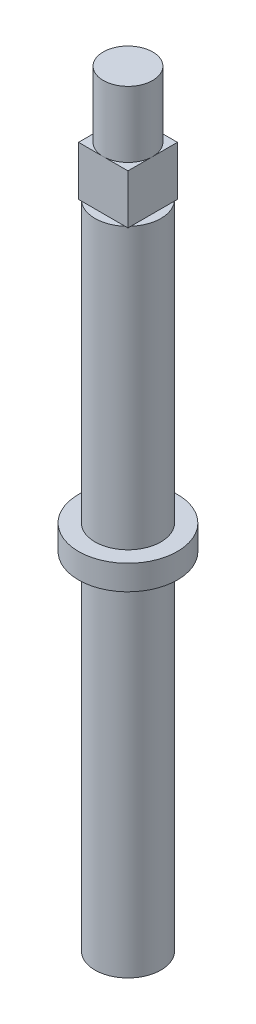
ISO-10303-21;
HEADER;
FILE_DESCRIPTION(('STEP AP214'),'2;1');
FILE_NAME('part.step','',(''),(''),'','','');
FILE_SCHEMA(('AUTOMOTIVE_DESIGN { 1 0 10303 214 1 1 1 1 }'));
ENDSEC;
DATA;
#1=APPLICATION_CONTEXT('core data for automotive mechanical design processes');
#2=APPLICATION_PROTOCOL_DEFINITION('international standard','automotive_design',2000,#1);
#3=PRODUCT_CONTEXT('',#1,'mechanical');
#4=PRODUCT('Part','Part','',(#3));
#5=PRODUCT_RELATED_PRODUCT_CATEGORY('part','',(#4));
#6=PRODUCT_DEFINITION_FORMATION('','',#4);
#7=PRODUCT_DEFINITION_CONTEXT('part definition',#1,'design');
#8=PRODUCT_DEFINITION('design','',#6,#7);
#9=PRODUCT_DEFINITION_SHAPE('','',#8);
#10=(LENGTH_UNIT() NAMED_UNIT(*) SI_UNIT(.MILLI.,.METRE.));
#11=(NAMED_UNIT(*) PLANE_ANGLE_UNIT() SI_UNIT($,.RADIAN.));
#12=(NAMED_UNIT(*) SI_UNIT($,.STERADIAN.) SOLID_ANGLE_UNIT());
#13=UNCERTAINTY_MEASURE_WITH_UNIT(LENGTH_MEASURE(1.E-05),#10,'distance_accuracy_value','');
#14=(GEOMETRIC_REPRESENTATION_CONTEXT(3) GLOBAL_UNCERTAINTY_ASSIGNED_CONTEXT((#13)) GLOBAL_UNIT_ASSIGNED_CONTEXT((#10,
#11,#12)) REPRESENTATION_CONTEXT('',''));
#15=CARTESIAN_POINT('',(0.,0.,0.));
#16=DIRECTION('',(0.,0.,1.));
#17=DIRECTION('',(1.,0.,0.));
#18=AXIS2_PLACEMENT_3D('',#15,#16,#17);
#19=CARTESIAN_POINT('',(0.,32.5,-3.00000000000001));
#20=DIRECTION('',(0.,-1.,0.));
#21=DIRECTION('',(0.,0.,-1.));
#22=AXIS2_PLACEMENT_3D('',#19,#20,#21);
#23=PLANE('',#22);
#24=DIRECTION('',(0.,0.,-1.));
#25=VECTOR('',#24,1.);
#26=CARTESIAN_POINT('',(3.,32.5,3.));
#27=LINE('',#26,#25);
#28=CARTESIAN_POINT('',(3.,32.5,2.64575131106459));
#29=VERTEX_POINT('',#28);
#30=CARTESIAN_POINT('',(3.,32.5,-2.64575131106461));
#31=VERTEX_POINT('',#30);
#32=EDGE_CURVE('E226',#29,#31,#27,.T.);
#33=ORIENTED_EDGE('',*,*,#32,.F.);
#34=CARTESIAN_POINT('',(0.,32.5,0.));
#35=DIRECTION('',(0.,1.,0.));
#36=DIRECTION('',(0.,0.,1.));
#37=AXIS2_PLACEMENT_3D('',#34,#35,#36);
#38=CIRCLE('',#37,4.);
#39=EDGE_CURVE('E185',#29,#31,#38,.T.);
#40=ORIENTED_EDGE('',*,*,#39,.T.);
#41=EDGE_LOOP('',(#33,#40));
#42=FACE_BOUND('',#41,.T.);
#43=ADVANCED_FACE('F49',(#42),#23,.F.);
#44=DIRECTION('',(-1.,0.,0.));
#45=VECTOR('',#44,1.);
#46=CARTESIAN_POINT('',(-3.,32.5,-3.));
#47=LINE('',#46,#45);
#48=CARTESIAN_POINT('',(2.6457513110646,32.5,-3.));
#49=VERTEX_POINT('',#48);
#50=CARTESIAN_POINT('',(-2.6457513110646,32.5,-3.));
#51=VERTEX_POINT('',#50);
#52=EDGE_CURVE('E231',#49,#51,#47,.T.);
#53=ORIENTED_EDGE('',*,*,#52,.F.);
#54=EDGE_CURVE('E289',#49,#51,#38,.T.);
#55=ORIENTED_EDGE('',*,*,#54,.T.);
#56=EDGE_LOOP('',(#53,#55));
#57=FACE_BOUND('',#56,.T.);
#58=ADVANCED_FACE('F309',(#57),#23,.F.);
#59=DIRECTION('',(0.,0.,1.));
#60=VECTOR('',#59,1.);
#61=CARTESIAN_POINT('',(-3.,32.5,3.));
#62=LINE('',#61,#60);
#63=CARTESIAN_POINT('',(-3.,32.5,-2.64575131106461));
#64=VERTEX_POINT('',#63);
#65=CARTESIAN_POINT('',(-3.,32.5,2.64575131106459));
#66=VERTEX_POINT('',#65);
#67=EDGE_CURVE('E237',#64,#66,#62,.T.);
#68=ORIENTED_EDGE('',*,*,#67,.F.);
#69=EDGE_CURVE('E254',#64,#66,#38,.T.);
#70=ORIENTED_EDGE('',*,*,#69,.T.);
#71=EDGE_LOOP('',(#68,#70));
#72=FACE_BOUND('',#71,.T.);
#73=ADVANCED_FACE('F307',(#72),#23,.F.);
#74=DIRECTION('',(1.,0.,0.));
#75=VECTOR('',#74,1.);
#76=CARTESIAN_POINT('',(-3.,32.5,3.));
#77=LINE('',#76,#75);
#78=CARTESIAN_POINT('',(-2.64575131106459,32.5,2.99999999999999));
#79=VERTEX_POINT('',#78);
#80=CARTESIAN_POINT('',(2.64575131106459,32.5,2.99999999999999));
#81=VERTEX_POINT('',#80);
#82=EDGE_CURVE('E240',#79,#81,#77,.T.);
#83=ORIENTED_EDGE('',*,*,#82,.F.);
#84=EDGE_CURVE('E180',#79,#81,#38,.T.);
#85=ORIENTED_EDGE('',*,*,#84,.T.);
#86=EDGE_LOOP('',(#83,#85));
#87=FACE_BOUND('',#86,.T.);
#88=ADVANCED_FACE('F261',(#87),#23,.F.);
#89=CARTESIAN_POINT('',(0.,46.5,0.));
#90=DIRECTION('',(0.,1.,0.));
#91=DIRECTION('',(0.,0.,1.));
#92=AXIS2_PLACEMENT_3D('',#89,#90,#91);
#93=CYLINDRICAL_SURFACE('',#92,4.00000000000001);
#94=EDGE_CURVE('E181',#81,#29,#38,.T.);
#95=ORIENTED_EDGE('',*,*,#94,.F.);
#96=ORIENTED_EDGE('',*,*,#84,.F.);
#97=EDGE_CURVE('E249',#66,#79,#38,.T.);
#98=ORIENTED_EDGE('',*,*,#97,.F.);
#99=ORIENTED_EDGE('',*,*,#69,.F.);
#100=EDGE_CURVE('E257',#51,#64,#38,.T.);
#101=ORIENTED_EDGE('',*,*,#100,.F.);
#102=ORIENTED_EDGE('',*,*,#54,.F.);
#103=EDGE_CURVE('E291',#31,#49,#38,.T.);
#104=ORIENTED_EDGE('',*,*,#103,.F.);
#105=ORIENTED_EDGE('',*,*,#39,.F.);
#106=EDGE_LOOP('',(#95,#96,#98,#99,#101,#102,#104,#105));
#107=FACE_BOUND('',#106,.T.);
#108=CARTESIAN_POINT('',(0.,-1.49999999999999,0.));
#109=DIRECTION('',(0.,1.,0.));
#110=DIRECTION('',(0.,0.,1.));
#111=AXIS2_PLACEMENT_3D('',#108,#109,#110);
#112=CIRCLE('',#111,4.00000000000001);
#113=CARTESIAN_POINT('',(0.,-1.49999999999999,4.));
#114=VERTEX_POINT('',#113);
#115=EDGE_CURVE('E176',#114,#114,#112,.T.);
#116=ORIENTED_EDGE('',*,*,#115,.T.);
#117=EDGE_LOOP('',(#116));
#118=FACE_BOUND('',#117,.T.);
#119=ADVANCED_FACE('F264',(#107,#118),#93,.T.);
#120=CARTESIAN_POINT('',(0.,-1.5,-4.00000000000002));
#121=DIRECTION('',(0.,-1.,0.));
#122=DIRECTION('',(0.,0.,-1.));
#123=AXIS2_PLACEMENT_3D('',#120,#121,#122);
#124=PLANE('',#123);
#125=ORIENTED_EDGE('',*,*,#115,.F.);
#126=EDGE_LOOP('',(#125));
#127=FACE_BOUND('',#126,.T.);
#128=CARTESIAN_POINT('',(0.,-1.49999999999999,0.));
#129=DIRECTION('',(0.,1.,0.));
#130=DIRECTION('',(0.,0.,1.));
#131=AXIS2_PLACEMENT_3D('',#128,#129,#130);
#132=CIRCLE('',#131,6.00000000000001);
#133=CARTESIAN_POINT('',(0.,-1.49999999999999,6.));
#134=VERTEX_POINT('',#133);
#135=EDGE_CURVE('E172',#134,#134,#132,.T.);
#136=ORIENTED_EDGE('',*,*,#135,.T.);
#137=EDGE_LOOP('',(#136));
#138=FACE_BOUND('',#137,.T.);
#139=ADVANCED_FACE('F475',(#127,#138),#124,.F.);
#140=CARTESIAN_POINT('',(0.,46.5,0.));
#141=DIRECTION('',(0.,1.,0.));
#142=DIRECTION('',(0.,0.,1.));
#143=AXIS2_PLACEMENT_3D('',#140,#141,#142);
#144=CYLINDRICAL_SURFACE('',#143,6.00000000000001);
#145=ORIENTED_EDGE('',*,*,#135,.F.);
#146=EDGE_LOOP('',(#145));
#147=FACE_BOUND('',#146,.T.);
#148=CARTESIAN_POINT('',(0.,-4.5,0.));
#149=DIRECTION('',(0.,1.,0.));
#150=DIRECTION('',(0.,0.,1.));
#151=AXIS2_PLACEMENT_3D('',#148,#149,#150);
#152=CIRCLE('',#151,6.00000000000001);
#153=CARTESIAN_POINT('',(0.,-4.5,6.));
#154=VERTEX_POINT('',#153);
#155=EDGE_CURVE('E168',#154,#154,#152,.T.);
#156=ORIENTED_EDGE('',*,*,#155,.T.);
#157=EDGE_LOOP('',(#156));
#158=FACE_BOUND('',#157,.T.);
#159=ADVANCED_FACE('F506',(#147,#158),#144,.T.);
#160=CARTESIAN_POINT('',(0.,-4.5,-6.00000000000001));
#161=DIRECTION('',(0.,1.,0.));
#162=DIRECTION('',(0.,0.,1.));
#163=AXIS2_PLACEMENT_3D('',#160,#161,#162);
#164=PLANE('',#163);
#165=ORIENTED_EDGE('',*,*,#155,.F.);
#166=EDGE_LOOP('',(#165));
#167=FACE_BOUND('',#166,.T.);
#168=CARTESIAN_POINT('',(0.,-4.5,0.));
#169=DIRECTION('',(0.,1.,0.));
#170=DIRECTION('',(0.,0.,1.));
#171=AXIS2_PLACEMENT_3D('',#168,#169,#170);
#172=CIRCLE('',#171,4.00000000000001);
#173=CARTESIAN_POINT('',(0.,-4.5,4.));
#174=VERTEX_POINT('',#173);
#175=EDGE_CURVE('E158',#174,#174,#172,.T.);
#176=ORIENTED_EDGE('',*,*,#175,.T.);
#177=EDGE_LOOP('',(#176));
#178=FACE_BOUND('',#177,.T.);
#179=ADVANCED_FACE('F497',(#167,#178),#164,.F.);
#180=CARTESIAN_POINT('',(0.,46.5,0.));
#181=DIRECTION('',(0.,1.,0.));
#182=DIRECTION('',(0.,0.,1.));
#183=AXIS2_PLACEMENT_3D('',#180,#181,#182);
#184=CYLINDRICAL_SURFACE('',#183,4.00000000000001);
#185=ORIENTED_EDGE('',*,*,#175,.F.);
#186=EDGE_LOOP('',(#185));
#187=FACE_BOUND('',#186,.T.);
#188=CARTESIAN_POINT('',(0.,-46.5,0.));
#189=DIRECTION('',(0.,1.,0.));
#190=DIRECTION('',(0.,0.,1.));
#191=AXIS2_PLACEMENT_3D('',#188,#189,#190);
#192=CIRCLE('',#191,4.00000000000001);
#193=CARTESIAN_POINT('',(0.,-46.5,4.00000000000001));
#194=VERTEX_POINT('',#193);
#195=EDGE_CURVE('E152',#194,#194,#192,.T.);
#196=ORIENTED_EDGE('',*,*,#195,.T.);
#197=EDGE_LOOP('',(#196));
#198=FACE_BOUND('',#197,.T.);
#199=ADVANCED_FACE('F489',(#187,#198),#184,.T.);
#200=CARTESIAN_POINT('',(0.,-46.5,-4.00000000000001));
#201=DIRECTION('',(0.,1.,0.));
#202=DIRECTION('',(0.,0.,1.));
#203=AXIS2_PLACEMENT_3D('',#200,#201,#202);
#204=PLANE('',#203);
#205=ORIENTED_EDGE('',*,*,#195,.F.);
#206=EDGE_LOOP('',(#205));
#207=FACE_BOUND('',#206,.T.);
#208=ADVANCED_FACE('F325',(#207),#204,.F.);
#209=CARTESIAN_POINT('',(0.,38.5,0.));
#210=DIRECTION('',(0.,-1.,0.));
#211=DIRECTION('',(0.,0.,-1.));
#212=AXIS2_PLACEMENT_3D('',#209,#210,#211);
#213=PLANE('',#212);
#214=DIRECTION('',(-1.,0.,0.));
#215=VECTOR('',#214,1.);
#216=CARTESIAN_POINT('',(-3.,38.5,-3.));
#217=LINE('',#216,#215);
#218=CARTESIAN_POINT('',(3.,38.5,-3.));
#219=VERTEX_POINT('',#218);
#220=CARTESIAN_POINT('',(0.,38.5,-3.));
#221=VERTEX_POINT('',#220);
#222=EDGE_CURVE('E127',#219,#221,#217,.T.);
#223=ORIENTED_EDGE('',*,*,#222,.T.);
#224=CARTESIAN_POINT('',(0.,38.5,0.));
#225=DIRECTION('',(0.,-1.,0.));
#226=DIRECTION('',(0.,0.,-1.));
#227=AXIS2_PLACEMENT_3D('',#224,#225,#226);
#228=CIRCLE('',#227,3.);
#229=CARTESIAN_POINT('',(3.,38.5,0.));
#230=VERTEX_POINT('',#229);
#231=EDGE_CURVE('E11',#221,#230,#228,.T.);
#232=ORIENTED_EDGE('',*,*,#231,.T.);
#233=DIRECTION('',(0.,0.,-1.));
#234=VECTOR('',#233,1.);
#235=CARTESIAN_POINT('',(3.,38.5,3.));
#236=LINE('',#235,#234);
#237=EDGE_CURVE('E124',#230,#219,#236,.T.);
#238=ORIENTED_EDGE('',*,*,#237,.T.);
#239=EDGE_LOOP('',(#223,#232,#238));
#240=FACE_BOUND('',#239,.T.);
#241=ADVANCED_FACE('F126',(#240),#213,.F.);
#242=CARTESIAN_POINT('',(3.,38.5,3.));
#243=VERTEX_POINT('',#242);
#244=EDGE_CURVE('E133',#243,#230,#236,.T.);
#245=ORIENTED_EDGE('',*,*,#244,.T.);
#246=CARTESIAN_POINT('',(0.,38.5,3.));
#247=VERTEX_POINT('',#246);
#248=EDGE_CURVE('E59',#230,#247,#228,.T.);
#249=ORIENTED_EDGE('',*,*,#248,.T.);
#250=DIRECTION('',(1.,0.,0.));
#251=VECTOR('',#250,1.);
#252=CARTESIAN_POINT('',(-3.,38.5,3.));
#253=LINE('',#252,#251);
#254=EDGE_CURVE('E202',#247,#243,#253,.T.);
#255=ORIENTED_EDGE('',*,*,#254,.T.);
#256=EDGE_LOOP('',(#245,#249,#255));
#257=FACE_BOUND('',#256,.T.);
#258=ADVANCED_FACE('F201',(#257),#213,.F.);
#259=CARTESIAN_POINT('',(-3.,38.5,3.));
#260=VERTEX_POINT('',#259);
#261=EDGE_CURVE('E208',#260,#247,#253,.T.);
#262=ORIENTED_EDGE('',*,*,#261,.T.);
#263=CARTESIAN_POINT('',(-3.,38.5,0.));
#264=VERTEX_POINT('',#263);
#265=EDGE_CURVE('E69',#247,#264,#228,.T.);
#266=ORIENTED_EDGE('',*,*,#265,.T.);
#267=DIRECTION('',(0.,0.,1.));
#268=VECTOR('',#267,1.);
#269=CARTESIAN_POINT('',(-3.,38.5,3.));
#270=LINE('',#269,#268);
#271=EDGE_CURVE('E145',#264,#260,#270,.T.);
#272=ORIENTED_EDGE('',*,*,#271,.T.);
#273=EDGE_LOOP('',(#262,#266,#272));
#274=FACE_BOUND('',#273,.T.);
#275=ADVANCED_FACE('F214',(#274),#213,.F.);
#276=CARTESIAN_POINT('',(3.,38.5,3.));
#277=DIRECTION('',(-1.,0.,0.));
#278=DIRECTION('',(0.,0.,1.));
#279=AXIS2_PLACEMENT_3D('',#276,#277,#278);
#280=PLANE('',#279);
#281=ORIENTED_EDGE('',*,*,#32,.T.);
#282=CARTESIAN_POINT('',(3.,32.5,-3.));
#283=VERTEX_POINT('',#282);
#284=EDGE_CURVE('E149',#31,#283,#27,.T.);
#285=ORIENTED_EDGE('',*,*,#284,.T.);
#286=DIRECTION('',(0.,-1.,0.));
#287=VECTOR('',#286,1.);
#288=CARTESIAN_POINT('',(3.,38.5,-3.));
#289=LINE('',#288,#287);
#290=EDGE_CURVE('E141',#219,#283,#289,.T.);
#291=ORIENTED_EDGE('',*,*,#290,.F.);
#292=ORIENTED_EDGE('',*,*,#237,.F.);
#293=ORIENTED_EDGE('',*,*,#244,.F.);
#294=DIRECTION('',(0.,-1.,0.));
#295=VECTOR('',#294,1.);
#296=CARTESIAN_POINT('',(3.,38.5,3.));
#297=LINE('',#296,#295);
#298=CARTESIAN_POINT('',(3.,32.5,3.));
#299=VERTEX_POINT('',#298);
#300=EDGE_CURVE('E210',#243,#299,#297,.T.);
#301=ORIENTED_EDGE('',*,*,#300,.T.);
#302=EDGE_CURVE('E221',#299,#29,#27,.T.);
#303=ORIENTED_EDGE('',*,*,#302,.T.);
#304=EDGE_LOOP('',(#281,#285,#291,#292,#293,#301,#303));
#305=FACE_BOUND('',#304,.T.);
#306=ADVANCED_FACE('F147',(#305),#280,.F.);
#307=CARTESIAN_POINT('',(-3.,38.5,-3.));
#308=DIRECTION('',(0.,0.,1.));
#309=DIRECTION('',(0.,-1.,0.));
#310=AXIS2_PLACEMENT_3D('',#307,#308,#309);
#311=PLANE('',#310);
#312=ORIENTED_EDGE('',*,*,#52,.T.);
#313=CARTESIAN_POINT('',(-3.,32.5,-3.));
#314=VERTEX_POINT('',#313);
#315=EDGE_CURVE('E225',#51,#314,#47,.T.);
#316=ORIENTED_EDGE('',*,*,#315,.T.);
#317=DIRECTION('',(0.,-1.,0.));
#318=VECTOR('',#317,1.);
#319=CARTESIAN_POINT('',(-3.,38.5,-3.));
#320=LINE('',#319,#318);
#321=CARTESIAN_POINT('',(-3.,38.5,-3.));
#322=VERTEX_POINT('',#321);
#323=EDGE_CURVE('E153',#322,#314,#320,.T.);
#324=ORIENTED_EDGE('',*,*,#323,.F.);
#325=EDGE_CURVE('E143',#221,#322,#217,.T.);
#326=ORIENTED_EDGE('',*,*,#325,.F.);
#327=ORIENTED_EDGE('',*,*,#222,.F.);
#328=ORIENTED_EDGE('',*,*,#290,.T.);
#329=EDGE_CURVE('E227',#283,#49,#47,.T.);
#330=ORIENTED_EDGE('',*,*,#329,.T.);
#331=EDGE_LOOP('',(#312,#316,#324,#326,#327,#328,#330));
#332=FACE_BOUND('',#331,.T.);
#333=ADVANCED_FACE('F139',(#332),#311,.F.);
#334=CARTESIAN_POINT('',(-3.,38.5,3.));
#335=DIRECTION('',(1.,0.,0.));
#336=DIRECTION('',(0.,0.,-1.));
#337=AXIS2_PLACEMENT_3D('',#334,#335,#336);
#338=PLANE('',#337);
#339=ORIENTED_EDGE('',*,*,#67,.T.);
#340=CARTESIAN_POINT('',(-3.,32.5,3.));
#341=VERTEX_POINT('',#340);
#342=EDGE_CURVE('E230',#66,#341,#62,.T.);
#343=ORIENTED_EDGE('',*,*,#342,.T.);
#344=DIRECTION('',(0.,-1.,0.));
#345=VECTOR('',#344,1.);
#346=CARTESIAN_POINT('',(-3.,38.5,3.));
#347=LINE('',#346,#345);
#348=EDGE_CURVE('E161',#260,#341,#347,.T.);
#349=ORIENTED_EDGE('',*,*,#348,.F.);
#350=ORIENTED_EDGE('',*,*,#271,.F.);
#351=EDGE_CURVE('E212',#322,#264,#270,.T.);
#352=ORIENTED_EDGE('',*,*,#351,.F.);
#353=ORIENTED_EDGE('',*,*,#323,.T.);
#354=EDGE_CURVE('E232',#314,#64,#62,.T.);
#355=ORIENTED_EDGE('',*,*,#354,.T.);
#356=EDGE_LOOP('',(#339,#343,#349,#350,#352,#353,#355));
#357=FACE_BOUND('',#356,.T.);
#358=ADVANCED_FACE('F279',(#357),#338,.F.);
#359=CARTESIAN_POINT('',(-3.,38.5,3.));
#360=DIRECTION('',(0.,0.,-1.));
#361=DIRECTION('',(0.,1.,0.));
#362=AXIS2_PLACEMENT_3D('',#359,#360,#361);
#363=PLANE('',#362);
#364=ORIENTED_EDGE('',*,*,#82,.T.);
#365=EDGE_CURVE('E236',#81,#299,#77,.T.);
#366=ORIENTED_EDGE('',*,*,#365,.T.);
#367=ORIENTED_EDGE('',*,*,#300,.F.);
#368=ORIENTED_EDGE('',*,*,#254,.F.);
#369=ORIENTED_EDGE('',*,*,#261,.F.);
#370=ORIENTED_EDGE('',*,*,#348,.T.);
#371=EDGE_CURVE('E134',#341,#79,#77,.T.);
#372=ORIENTED_EDGE('',*,*,#371,.T.);
#373=EDGE_LOOP('',(#364,#366,#367,#368,#369,#370,#372));
#374=FACE_BOUND('',#373,.T.);
#375=ADVANCED_FACE('F206',(#374),#363,.F.);
#376=CARTESIAN_POINT('',(0.,32.5,0.));
#377=DIRECTION('',(0.,-1.,0.));
#378=DIRECTION('',(0.,0.,-1.));
#379=AXIS2_PLACEMENT_3D('',#376,#377,#378);
#380=PLANE('',#379);
#381=ORIENTED_EDGE('',*,*,#103,.T.);
#382=ORIENTED_EDGE('',*,*,#329,.F.);
#383=ORIENTED_EDGE('',*,*,#284,.F.);
#384=EDGE_LOOP('',(#381,#382,#383));
#385=FACE_BOUND('',#384,.T.);
#386=ADVANCED_FACE('F298',(#385),#380,.T.);
#387=ORIENTED_EDGE('',*,*,#94,.T.);
#388=ORIENTED_EDGE('',*,*,#302,.F.);
#389=ORIENTED_EDGE('',*,*,#365,.F.);
#390=EDGE_LOOP('',(#387,#388,#389));
#391=FACE_BOUND('',#390,.T.);
#392=ADVANCED_FACE('F270',(#391),#380,.T.);
#393=ORIENTED_EDGE('',*,*,#97,.T.);
#394=ORIENTED_EDGE('',*,*,#371,.F.);
#395=ORIENTED_EDGE('',*,*,#342,.F.);
#396=EDGE_LOOP('',(#393,#394,#395));
#397=FACE_BOUND('',#396,.T.);
#398=ADVANCED_FACE('F247',(#397),#380,.T.);
#399=ORIENTED_EDGE('',*,*,#351,.T.);
#400=EDGE_CURVE('E53',#264,#221,#228,.T.);
#401=ORIENTED_EDGE('',*,*,#400,.T.);
#402=ORIENTED_EDGE('',*,*,#325,.T.);
#403=EDGE_LOOP('',(#399,#401,#402));
#404=FACE_BOUND('',#403,.T.);
#405=ADVANCED_FACE('F278',(#404),#213,.F.);
#406=ORIENTED_EDGE('',*,*,#100,.T.);
#407=ORIENTED_EDGE('',*,*,#354,.F.);
#408=ORIENTED_EDGE('',*,*,#315,.F.);
#409=EDGE_LOOP('',(#406,#407,#408));
#410=FACE_BOUND('',#409,.T.);
#411=ADVANCED_FACE('F284',(#410),#380,.T.);
#412=CARTESIAN_POINT('',(0.,46.5,0.));
#413=DIRECTION('',(0.,-1.,0.));
#414=DIRECTION('',(0.,0.,-1.));
#415=AXIS2_PLACEMENT_3D('',#412,#413,#414);
#416=PLANE('',#415);
#417=CARTESIAN_POINT('',(0.,46.5,0.));
#418=DIRECTION('',(0.,1.,0.));
#419=DIRECTION('',(0.,0.,1.));
#420=AXIS2_PLACEMENT_3D('',#417,#418,#419);
#421=CIRCLE('',#420,3.);
#422=CARTESIAN_POINT('',(0.,46.5,2.99999999999999));
#423=VERTEX_POINT('',#422);
#424=EDGE_CURVE('E184',#423,#423,#421,.T.);
#425=ORIENTED_EDGE('',*,*,#424,.T.);
#426=EDGE_LOOP('',(#425));
#427=FACE_BOUND('',#426,.T.);
#428=ADVANCED_FACE('F51',(#427),#416,.F.);
#429=CARTESIAN_POINT('',(0.,46.5,0.));
#430=DIRECTION('',(0.,1.,0.));
#431=DIRECTION('',(0.,0.,1.));
#432=AXIS2_PLACEMENT_3D('',#429,#430,#431);
#433=CYLINDRICAL_SURFACE('',#432,3.);
#434=ORIENTED_EDGE('',*,*,#424,.F.);
#435=EDGE_LOOP('',(#434));
#436=FACE_BOUND('',#435,.T.);
#437=ORIENTED_EDGE('',*,*,#231,.F.);
#438=ORIENTED_EDGE('',*,*,#400,.F.);
#439=ORIENTED_EDGE('',*,*,#265,.F.);
#440=ORIENTED_EDGE('',*,*,#248,.F.);
#441=EDGE_LOOP('',(#437,#438,#439,#440));
#442=FACE_BOUND('',#441,.T.);
#443=ADVANCED_FACE('F339',(#436,#442),#433,.T.);
#444=CLOSED_SHELL('',(#43,#58,#73,#88,#119,#139,#159,#179,#199,#208,#241,#258,#275,#306,#333,
#358,#375,#386,#392,#398,#405,#411,#428,#443));
#445=MANIFOLD_SOLID_BREP('B2',#444);
#446=ADVANCED_BREP_SHAPE_REPRESENTATION('',(#18,#445),#14);
#447=SHAPE_DEFINITION_REPRESENTATION(#9,#446);
ENDSEC;
END-ISO-10303-21;
